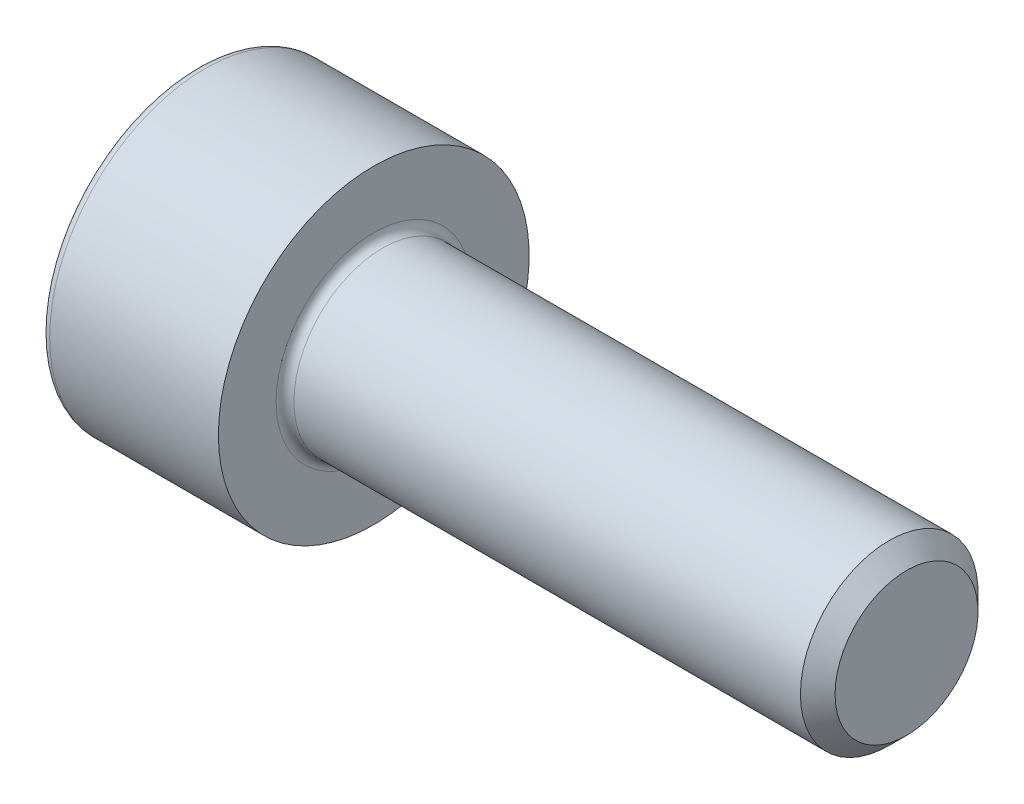
ISO-10303-21;
HEADER;
FILE_DESCRIPTION(('STEP AP214'),'2;1');
FILE_NAME('part.step','',(''),(''),'','','');
FILE_SCHEMA(('AUTOMOTIVE_DESIGN { 1 0 10303 214 1 1 1 1 }'));
ENDSEC;
DATA;
#1=APPLICATION_CONTEXT('core data for automotive mechanical design processes');
#2=APPLICATION_PROTOCOL_DEFINITION('international standard','automotive_design',2000,#1);
#3=PRODUCT_CONTEXT('',#1,'mechanical');
#4=PRODUCT('Part','Part','',(#3));
#5=PRODUCT_RELATED_PRODUCT_CATEGORY('part','',(#4));
#6=PRODUCT_DEFINITION_FORMATION('','',#4);
#7=PRODUCT_DEFINITION_CONTEXT('part definition',#1,'design');
#8=PRODUCT_DEFINITION('design','',#6,#7);
#9=PRODUCT_DEFINITION_SHAPE('','',#8);
#10=(LENGTH_UNIT() NAMED_UNIT(*) SI_UNIT(.MILLI.,.METRE.));
#11=(NAMED_UNIT(*) PLANE_ANGLE_UNIT() SI_UNIT($,.RADIAN.));
#12=(NAMED_UNIT(*) SI_UNIT($,.STERADIAN.) SOLID_ANGLE_UNIT());
#13=UNCERTAINTY_MEASURE_WITH_UNIT(LENGTH_MEASURE(1.E-05),#10,'distance_accuracy_value','');
#14=(GEOMETRIC_REPRESENTATION_CONTEXT(3) GLOBAL_UNCERTAINTY_ASSIGNED_CONTEXT((#13)) GLOBAL_UNIT_ASSIGNED_CONTEXT((#10,
#11,#12)) REPRESENTATION_CONTEXT('',''));
#15=CARTESIAN_POINT('',(0.,0.,0.));
#16=DIRECTION('',(0.,0.,1.));
#17=DIRECTION('',(1.,0.,0.));
#18=AXIS2_PLACEMENT_3D('',#15,#16,#17);
#19=CARTESIAN_POINT('',(0.,0.,0.));
#20=DIRECTION('',(-1.,0.,0.));
#21=DIRECTION('',(0.,0.,1.));
#22=AXIS2_PLACEMENT_3D('',#19,#20,#21);
#23=PLANE('',#22);
#24=DIRECTION('',(0.,-0.499999999999999,0.866025403784439));
#25=VECTOR('',#24,1.);
#26=CARTESIAN_POINT('',(0.,1.77304267668134,0.));
#27=LINE('',#26,#25);
#28=CARTESIAN_POINT('',(0.,1.77304267668134,0.));
#29=VERTEX_POINT('',#28);
#30=CARTESIAN_POINT('',(0.,0.886521338340669,1.5355));
#31=VERTEX_POINT('',#30);
#32=EDGE_CURVE('E109',#29,#31,#27,.T.);
#33=ORIENTED_EDGE('',*,*,#32,.T.);
#34=DIRECTION('',(0.,1.,0.));
#35=VECTOR('',#34,1.);
#36=CARTESIAN_POINT('',(0.,-0.886521338340671,1.5355));
#37=LINE('',#36,#35);
#38=CARTESIAN_POINT('',(0.,-0.886521338340671,1.5355));
#39=VERTEX_POINT('',#38);
#40=EDGE_CURVE('E98',#39,#31,#37,.T.);
#41=ORIENTED_EDGE('',*,*,#40,.F.);
#42=DIRECTION('',(0.,-0.500000000000001,-0.866025403784438));
#43=VECTOR('',#42,1.);
#44=CARTESIAN_POINT('',(0.,-0.886521338340671,1.5355));
#45=LINE('',#44,#43);
#46=CARTESIAN_POINT('',(0.,-1.77304267668134,0.));
#47=VERTEX_POINT('',#46);
#48=EDGE_CURVE('E108',#39,#47,#45,.T.);
#49=ORIENTED_EDGE('',*,*,#48,.T.);
#50=DIRECTION('',(0.,0.499999999999999,-0.866025403784439));
#51=VECTOR('',#50,1.);
#52=CARTESIAN_POINT('',(0.,-1.77304267668134,0.));
#53=LINE('',#52,#51);
#54=CARTESIAN_POINT('',(0.,-0.886521338340675,-1.5355));
#55=VERTEX_POINT('',#54);
#56=EDGE_CURVE('E123',#47,#55,#53,.T.);
#57=ORIENTED_EDGE('',*,*,#56,.T.);
#58=DIRECTION('',(0.,-1.,0.));
#59=VECTOR('',#58,1.);
#60=CARTESIAN_POINT('',(0.,0.886521338340665,-1.5355));
#61=LINE('',#60,#59);
#62=CARTESIAN_POINT('',(0.,0.886521338340665,-1.5355));
#63=VERTEX_POINT('',#62);
#64=EDGE_CURVE('E126',#63,#55,#61,.T.);
#65=ORIENTED_EDGE('',*,*,#64,.F.);
#66=DIRECTION('',(0.,-0.500000000000001,-0.866025403784438));
#67=VECTOR('',#66,1.);
#68=CARTESIAN_POINT('',(0.,1.77304267668134,0.));
#69=LINE('',#68,#67);
#70=EDGE_CURVE('E118',#29,#63,#69,.T.);
#71=ORIENTED_EDGE('',*,*,#70,.F.);
#72=EDGE_LOOP('',(#33,#41,#49,#57,#65,#71));
#73=FACE_BOUND('',#72,.T.);
#74=CARTESIAN_POINT('',(0.,0.,0.));
#75=DIRECTION('',(-1.,0.,0.));
#76=DIRECTION('',(0.,0.,1.));
#77=AXIS2_PLACEMENT_3D('',#74,#75,#76);
#78=CIRCLE('',#77,3.3);
#79=CARTESIAN_POINT('',(0.,0.,3.3));
#80=VERTEX_POINT('',#79);
#81=EDGE_CURVE('E33',#80,#80,#78,.T.);
#82=ORIENTED_EDGE('',*,*,#81,.T.);
#83=EDGE_LOOP('',(#82));
#84=FACE_BOUND('',#83,.T.);
#85=ADVANCED_FACE('F26',(#73,#84),#23,.T.);
#86=CARTESIAN_POINT('',(-31.75,0.,0.));
#87=DIRECTION('',(-1.,0.,0.));
#88=DIRECTION('',(0.,0.,1.));
#89=AXIS2_PLACEMENT_3D('',#86,#87,#88);
#90=CYLINDRICAL_SURFACE('',#89,3.5);
#91=CARTESIAN_POINT('',(0.199999999999999,0.,0.));
#92=DIRECTION('',(-1.,0.,0.));
#93=DIRECTION('',(0.,0.,1.));
#94=AXIS2_PLACEMENT_3D('',#91,#92,#93);
#95=CIRCLE('',#94,3.5);
#96=CARTESIAN_POINT('',(0.199999999999999,0.,3.5));
#97=VERTEX_POINT('',#96);
#98=EDGE_CURVE('E11',#97,#97,#95,.F.);
#99=ORIENTED_EDGE('',*,*,#98,.T.);
#100=EDGE_LOOP('',(#99));
#101=FACE_BOUND('',#100,.T.);
#102=CARTESIAN_POINT('',(4.,0.,0.));
#103=DIRECTION('',(-1.,0.,0.));
#104=DIRECTION('',(0.,0.,1.));
#105=AXIS2_PLACEMENT_3D('',#102,#103,#104);
#106=CIRCLE('',#105,3.5);
#107=CARTESIAN_POINT('',(4.,0.,3.5));
#108=VERTEX_POINT('',#107);
#109=EDGE_CURVE('E172',#108,#108,#106,.T.);
#110=ORIENTED_EDGE('',*,*,#109,.T.);
#111=EDGE_LOOP('',(#110));
#112=FACE_BOUND('',#111,.T.);
#113=ADVANCED_FACE('F200',(#101,#112),#90,.T.);
#114=CARTESIAN_POINT('',(4.,3.5,0.));
#115=DIRECTION('',(1.,0.,0.));
#116=DIRECTION('',(0.,0.,-1.));
#117=AXIS2_PLACEMENT_3D('',#114,#115,#116);
#118=PLANE('',#117);
#119=CARTESIAN_POINT('',(4.,0.,0.));
#120=DIRECTION('',(1.,0.,0.));
#121=DIRECTION('',(0.,0.,-1.));
#122=AXIS2_PLACEMENT_3D('',#119,#120,#121);
#123=CIRCLE('',#122,2.2);
#124=CARTESIAN_POINT('',(4.,0.,-2.2));
#125=VERTEX_POINT('',#124);
#126=EDGE_CURVE('E175',#125,#125,#123,.F.);
#127=ORIENTED_EDGE('',*,*,#126,.T.);
#128=EDGE_LOOP('',(#127));
#129=FACE_BOUND('',#128,.T.);
#130=ORIENTED_EDGE('',*,*,#109,.F.);
#131=EDGE_LOOP('',(#130));
#132=FACE_BOUND('',#131,.T.);
#133=ADVANCED_FACE('F203',(#129,#132),#118,.T.);
#134=CARTESIAN_POINT('',(-31.75,0.,0.));
#135=DIRECTION('',(-1.,0.,0.));
#136=DIRECTION('',(0.,0.,1.));
#137=AXIS2_PLACEMENT_3D('',#134,#135,#136);
#138=CYLINDRICAL_SURFACE('',#137,2.);
#139=CARTESIAN_POINT('',(4.2,0.,0.));
#140=DIRECTION('',(1.,0.,0.));
#141=DIRECTION('',(0.,0.,-1.));
#142=AXIS2_PLACEMENT_3D('',#139,#140,#141);
#143=CIRCLE('',#142,2.);
#144=CARTESIAN_POINT('',(4.2,0.,-2.));
#145=VERTEX_POINT('',#144);
#146=EDGE_CURVE('E178',#145,#145,#143,.T.);
#147=ORIENTED_EDGE('',*,*,#146,.T.);
#148=EDGE_LOOP('',(#147));
#149=FACE_BOUND('',#148,.T.);
#150=CARTESIAN_POINT('',(15.61,0.,0.));
#151=DIRECTION('',(-1.,0.,0.));
#152=DIRECTION('',(0.,0.,1.));
#153=AXIS2_PLACEMENT_3D('',#150,#151,#152);
#154=CIRCLE('',#153,2.);
#155=CARTESIAN_POINT('',(15.61,0.,2.));
#156=VERTEX_POINT('',#155);
#157=EDGE_CURVE('E169',#156,#156,#154,.T.);
#158=ORIENTED_EDGE('',*,*,#157,.T.);
#159=EDGE_LOOP('',(#158));
#160=FACE_BOUND('',#159,.T.);
#161=ADVANCED_FACE('F208',(#149,#160),#138,.T.);
#162=CARTESIAN_POINT('',(16.,0.,0.));
#163=DIRECTION('',(-1.,0.,0.));
#164=DIRECTION('',(0.,0.,1.));
#165=AXIS2_PLACEMENT_3D('',#162,#163,#164);
#166=CONICAL_SURFACE('',#165,1.61,0.785398163397482);
#167=ORIENTED_EDGE('',*,*,#157,.F.);
#168=EDGE_LOOP('',(#167));
#169=FACE_BOUND('',#168,.T.);
#170=CARTESIAN_POINT('',(16.,0.,0.));
#171=DIRECTION('',(-1.,0.,0.));
#172=DIRECTION('',(0.,0.,1.));
#173=AXIS2_PLACEMENT_3D('',#170,#171,#172);
#174=CIRCLE('',#173,1.61);
#175=CARTESIAN_POINT('',(16.,0.,1.61));
#176=VERTEX_POINT('',#175);
#177=EDGE_CURVE('E165',#176,#176,#174,.T.);
#178=ORIENTED_EDGE('',*,*,#177,.T.);
#179=EDGE_LOOP('',(#178));
#180=FACE_BOUND('',#179,.T.);
#181=ADVANCED_FACE('F215',(#169,#180),#166,.T.);
#182=CARTESIAN_POINT('',(16.,1.61,0.));
#183=DIRECTION('',(1.,0.,0.));
#184=DIRECTION('',(0.,0.,-1.));
#185=AXIS2_PLACEMENT_3D('',#182,#183,#184);
#186=PLANE('',#185);
#187=ORIENTED_EDGE('',*,*,#177,.F.);
#188=EDGE_LOOP('',(#187));
#189=FACE_BOUND('',#188,.T.);
#190=ADVANCED_FACE('F195',(#189),#186,.T.);
#191=CARTESIAN_POINT('',(4.2,0.,0.));
#192=DIRECTION('',(1.,0.,0.));
#193=DIRECTION('',(0.,0.,-1.));
#194=AXIS2_PLACEMENT_3D('',#191,#192,#193);
#195=TOROIDAL_SURFACE('',#194,2.2,0.2);
#196=ORIENTED_EDGE('',*,*,#146,.F.);
#197=EDGE_LOOP('',(#196));
#198=FACE_BOUND('',#197,.T.);
#199=ORIENTED_EDGE('',*,*,#126,.F.);
#200=EDGE_LOOP('',(#199));
#201=FACE_BOUND('',#200,.T.);
#202=ADVANCED_FACE('F185',(#198,#201),#195,.F.);
#203=CARTESIAN_POINT('',(0.199999999999999,0.,0.));
#204=DIRECTION('',(-1.,0.,0.));
#205=DIRECTION('',(0.,0.,1.));
#206=AXIS2_PLACEMENT_3D('',#203,#204,#205);
#207=TOROIDAL_SURFACE('',#206,3.3,0.2);
#208=ORIENTED_EDGE('',*,*,#98,.F.);
#209=EDGE_LOOP('',(#208));
#210=FACE_BOUND('',#209,.T.);
#211=ORIENTED_EDGE('',*,*,#81,.F.);
#212=EDGE_LOOP('',(#211));
#213=FACE_BOUND('',#212,.T.);
#214=ADVANCED_FACE('F183',(#210,#213),#207,.T.);
#215=CARTESIAN_POINT('',(2.,1.77304267668134,0.));
#216=DIRECTION('',(0.,-0.866025403784439,-0.499999999999999));
#217=DIRECTION('',(0.,0.499999999999999,-0.866025403784439));
#218=AXIS2_PLACEMENT_3D('',#215,#216,#217);
#219=PLANE('',#218);
#220=ORIENTED_EDGE('',*,*,#32,.F.);
#221=DIRECTION('',(-1.,0.,0.));
#222=VECTOR('',#221,1.);
#223=CARTESIAN_POINT('',(2.,1.77304267668134,0.));
#224=LINE('',#223,#222);
#225=CARTESIAN_POINT('',(2.,1.77304267668134,0.));
#226=VERTEX_POINT('',#225);
#227=EDGE_CURVE('E150',#226,#29,#224,.T.);
#228=ORIENTED_EDGE('',*,*,#227,.F.);
#229=DIRECTION('',(0.,-0.499999999999999,0.866025403784439));
#230=VECTOR('',#229,1.);
#231=CARTESIAN_POINT('',(2.,1.77304267668134,0.));
#232=LINE('',#231,#230);
#233=CARTESIAN_POINT('',(2.,1.32978200751101,0.767749999999998));
#234=VERTEX_POINT('',#233);
#235=EDGE_CURVE('E40',#226,#234,#232,.T.);
#236=ORIENTED_EDGE('',*,*,#235,.T.);
#237=CARTESIAN_POINT('',(2.,0.886521338340669,1.5355));
#238=VERTEX_POINT('',#237);
#239=EDGE_CURVE('E113',#234,#238,#232,.T.);
#240=ORIENTED_EDGE('',*,*,#239,.T.);
#241=DIRECTION('',(-1.,0.,0.));
#242=VECTOR('',#241,1.);
#243=CARTESIAN_POINT('',(2.,0.886521338340669,1.5355));
#244=LINE('',#243,#242);
#245=EDGE_CURVE('E102',#238,#31,#244,.T.);
#246=ORIENTED_EDGE('',*,*,#245,.T.);
#247=EDGE_LOOP('',(#220,#228,#236,#240,#246));
#248=FACE_BOUND('',#247,.T.);
#249=ADVANCED_FACE('F111',(#248),#219,.T.);
#250=CARTESIAN_POINT('',(2.,-0.886521338340671,1.5355));
#251=DIRECTION('',(0.,0.,1.));
#252=DIRECTION('',(0.,-1.,0.));
#253=AXIS2_PLACEMENT_3D('',#250,#251,#252);
#254=PLANE('',#253);
#255=ORIENTED_EDGE('',*,*,#40,.T.);
#256=ORIENTED_EDGE('',*,*,#245,.F.);
#257=DIRECTION('',(0.,1.,0.));
#258=VECTOR('',#257,1.);
#259=CARTESIAN_POINT('',(2.,-0.886521338340671,1.5355));
#260=LINE('',#259,#258);
#261=CARTESIAN_POINT('',(2.,0.,1.5355));
#262=VERTEX_POINT('',#261);
#263=EDGE_CURVE('E130',#262,#238,#260,.T.);
#264=ORIENTED_EDGE('',*,*,#263,.F.);
#265=CARTESIAN_POINT('',(2.,-0.886521338340671,1.5355));
#266=VERTEX_POINT('',#265);
#267=EDGE_CURVE('E131',#266,#262,#260,.T.);
#268=ORIENTED_EDGE('',*,*,#267,.F.);
#269=DIRECTION('',(-1.,0.,0.));
#270=VECTOR('',#269,1.);
#271=CARTESIAN_POINT('',(2.,-0.886521338340671,1.5355));
#272=LINE('',#271,#270);
#273=EDGE_CURVE('E104',#266,#39,#272,.T.);
#274=ORIENTED_EDGE('',*,*,#273,.T.);
#275=EDGE_LOOP('',(#255,#256,#264,#268,#274));
#276=FACE_BOUND('',#275,.T.);
#277=ADVANCED_FACE('F100',(#276),#254,.F.);
#278=CARTESIAN_POINT('',(2.,-0.886521338340671,1.5355));
#279=DIRECTION('',(0.,0.866025403784438,-0.500000000000001));
#280=DIRECTION('',(0.,0.500000000000001,0.866025403784438));
#281=AXIS2_PLACEMENT_3D('',#278,#279,#280);
#282=PLANE('',#281);
#283=ORIENTED_EDGE('',*,*,#48,.F.);
#284=ORIENTED_EDGE('',*,*,#273,.F.);
#285=DIRECTION('',(0.,-0.500000000000001,-0.866025403784438));
#286=VECTOR('',#285,1.);
#287=CARTESIAN_POINT('',(2.,-0.886521338340671,1.5355));
#288=LINE('',#287,#286);
#289=CARTESIAN_POINT('',(2.,-1.329782007511,0.767750000000002));
#290=VERTEX_POINT('',#289);
#291=EDGE_CURVE('E135',#266,#290,#288,.T.);
#292=ORIENTED_EDGE('',*,*,#291,.T.);
#293=CARTESIAN_POINT('',(2.,-1.77304267668134,0.));
#294=VERTEX_POINT('',#293);
#295=EDGE_CURVE('E134',#290,#294,#288,.T.);
#296=ORIENTED_EDGE('',*,*,#295,.T.);
#297=DIRECTION('',(-1.,0.,0.));
#298=VECTOR('',#297,1.);
#299=CARTESIAN_POINT('',(2.,-1.77304267668134,0.));
#300=LINE('',#299,#298);
#301=EDGE_CURVE('E158',#294,#47,#300,.T.);
#302=ORIENTED_EDGE('',*,*,#301,.T.);
#303=EDGE_LOOP('',(#283,#284,#292,#296,#302));
#304=FACE_BOUND('',#303,.T.);
#305=ADVANCED_FACE('F263',(#304),#282,.T.);
#306=CARTESIAN_POINT('',(2.,-1.77304267668134,0.));
#307=DIRECTION('',(0.,0.866025403784439,0.499999999999999));
#308=DIRECTION('',(0.,-0.499999999999999,0.866025403784439));
#309=AXIS2_PLACEMENT_3D('',#306,#307,#308);
#310=PLANE('',#309);
#311=ORIENTED_EDGE('',*,*,#56,.F.);
#312=ORIENTED_EDGE('',*,*,#301,.F.);
#313=DIRECTION('',(0.,0.499999999999999,-0.866025403784439));
#314=VECTOR('',#313,1.);
#315=CARTESIAN_POINT('',(2.,-1.77304267668134,0.));
#316=LINE('',#315,#314);
#317=CARTESIAN_POINT('',(2.,-1.32978200751101,-0.76775));
#318=VERTEX_POINT('',#317);
#319=EDGE_CURVE('E139',#294,#318,#316,.T.);
#320=ORIENTED_EDGE('',*,*,#319,.T.);
#321=CARTESIAN_POINT('',(2.,-0.886521338340675,-1.5355));
#322=VERTEX_POINT('',#321);
#323=EDGE_CURVE('E138',#318,#322,#316,.T.);
#324=ORIENTED_EDGE('',*,*,#323,.T.);
#325=DIRECTION('',(-1.,0.,0.));
#326=VECTOR('',#325,1.);
#327=CARTESIAN_POINT('',(2.,-0.886521338340675,-1.5355));
#328=LINE('',#327,#326);
#329=EDGE_CURVE('E155',#322,#55,#328,.T.);
#330=ORIENTED_EDGE('',*,*,#329,.T.);
#331=EDGE_LOOP('',(#311,#312,#320,#324,#330));
#332=FACE_BOUND('',#331,.T.);
#333=ADVANCED_FACE('F270',(#332),#310,.T.);
#334=CARTESIAN_POINT('',(2.,0.886521338340665,-1.5355));
#335=DIRECTION('',(0.,0.,-1.));
#336=DIRECTION('',(0.,1.,0.));
#337=AXIS2_PLACEMENT_3D('',#334,#335,#336);
#338=PLANE('',#337);
#339=ORIENTED_EDGE('',*,*,#64,.T.);
#340=ORIENTED_EDGE('',*,*,#329,.F.);
#341=DIRECTION('',(0.,-1.,0.));
#342=VECTOR('',#341,1.);
#343=CARTESIAN_POINT('',(2.,0.886521338340665,-1.5355));
#344=LINE('',#343,#342);
#345=CARTESIAN_POINT('',(2.,0.,-1.5355));
#346=VERTEX_POINT('',#345);
#347=EDGE_CURVE('E142',#346,#322,#344,.T.);
#348=ORIENTED_EDGE('',*,*,#347,.F.);
#349=CARTESIAN_POINT('',(2.,0.886521338340665,-1.5355));
#350=VERTEX_POINT('',#349);
#351=EDGE_CURVE('E143',#350,#346,#344,.T.);
#352=ORIENTED_EDGE('',*,*,#351,.F.);
#353=DIRECTION('',(-1.,0.,0.));
#354=VECTOR('',#353,1.);
#355=CARTESIAN_POINT('',(2.,0.886521338340665,-1.5355));
#356=LINE('',#355,#354);
#357=EDGE_CURVE('E152',#350,#63,#356,.T.);
#358=ORIENTED_EDGE('',*,*,#357,.T.);
#359=EDGE_LOOP('',(#339,#340,#348,#352,#358));
#360=FACE_BOUND('',#359,.T.);
#361=ADVANCED_FACE('F278',(#360),#338,.F.);
#362=CARTESIAN_POINT('',(2.,1.77304267668134,0.));
#363=DIRECTION('',(0.,0.866025403784438,-0.500000000000001));
#364=DIRECTION('',(0.,0.500000000000001,0.866025403784438));
#365=AXIS2_PLACEMENT_3D('',#362,#363,#364);
#366=PLANE('',#365);
#367=ORIENTED_EDGE('',*,*,#70,.T.);
#368=ORIENTED_EDGE('',*,*,#357,.F.);
#369=DIRECTION('',(0.,-0.500000000000001,-0.866025403784438));
#370=VECTOR('',#369,1.);
#371=CARTESIAN_POINT('',(2.,1.77304267668134,0.));
#372=LINE('',#371,#370);
#373=CARTESIAN_POINT('',(2.,1.329782007511,-0.767750000000001));
#374=VERTEX_POINT('',#373);
#375=EDGE_CURVE('E146',#374,#350,#372,.T.);
#376=ORIENTED_EDGE('',*,*,#375,.F.);
#377=EDGE_CURVE('E147',#226,#374,#372,.T.);
#378=ORIENTED_EDGE('',*,*,#377,.F.);
#379=ORIENTED_EDGE('',*,*,#227,.T.);
#380=EDGE_LOOP('',(#367,#368,#376,#378,#379));
#381=FACE_BOUND('',#380,.T.);
#382=ADVANCED_FACE('F286',(#381),#366,.F.);
#383=CARTESIAN_POINT('',(2.,0.88652133834067,1.5355));
#384=DIRECTION('',(-1.,0.,0.));
#385=DIRECTION('',(0.,0.,1.));
#386=AXIS2_PLACEMENT_3D('',#383,#384,#385);
#387=PLANE('',#386);
#388=CARTESIAN_POINT('',(2.,0.,0.));
#389=DIRECTION('',(-1.,0.,0.));
#390=DIRECTION('',(0.,0.,1.));
#391=AXIS2_PLACEMENT_3D('',#388,#389,#390);
#392=CIRCLE('',#391,1.5355);
#393=EDGE_CURVE('E114',#290,#262,#392,.T.);
#394=ORIENTED_EDGE('',*,*,#393,.F.);
#395=ORIENTED_EDGE('',*,*,#291,.F.);
#396=ORIENTED_EDGE('',*,*,#267,.T.);
#397=EDGE_LOOP('',(#394,#395,#396));
#398=FACE_BOUND('',#397,.T.);
#399=ADVANCED_FACE('F294',(#398),#387,.T.);
#400=EDGE_CURVE('E345',#318,#290,#392,.T.);
#401=ORIENTED_EDGE('',*,*,#400,.F.);
#402=ORIENTED_EDGE('',*,*,#319,.F.);
#403=ORIENTED_EDGE('',*,*,#295,.F.);
#404=EDGE_LOOP('',(#401,#402,#403));
#405=FACE_BOUND('',#404,.T.);
#406=ADVANCED_FACE('F302',(#405),#387,.T.);
#407=EDGE_CURVE('E346',#346,#318,#392,.T.);
#408=ORIENTED_EDGE('',*,*,#407,.F.);
#409=ORIENTED_EDGE('',*,*,#347,.T.);
#410=ORIENTED_EDGE('',*,*,#323,.F.);
#411=EDGE_LOOP('',(#408,#409,#410));
#412=FACE_BOUND('',#411,.T.);
#413=ADVANCED_FACE('F310',(#412),#387,.T.);
#414=EDGE_CURVE('E347',#374,#346,#392,.T.);
#415=ORIENTED_EDGE('',*,*,#414,.F.);
#416=ORIENTED_EDGE('',*,*,#375,.T.);
#417=ORIENTED_EDGE('',*,*,#351,.T.);
#418=EDGE_LOOP('',(#415,#416,#417));
#419=FACE_BOUND('',#418,.T.);
#420=ADVANCED_FACE('F317',(#419),#387,.T.);
#421=EDGE_CURVE('E166',#234,#374,#392,.T.);
#422=ORIENTED_EDGE('',*,*,#421,.F.);
#423=ORIENTED_EDGE('',*,*,#235,.F.);
#424=ORIENTED_EDGE('',*,*,#377,.T.);
#425=EDGE_LOOP('',(#422,#423,#424));
#426=FACE_BOUND('',#425,.T.);
#427=ADVANCED_FACE('F324',(#426),#387,.T.);
#428=EDGE_CURVE('E162',#262,#234,#392,.T.);
#429=ORIENTED_EDGE('',*,*,#428,.F.);
#430=ORIENTED_EDGE('',*,*,#263,.T.);
#431=ORIENTED_EDGE('',*,*,#239,.F.);
#432=EDGE_LOOP('',(#429,#430,#431));
#433=FACE_BOUND('',#432,.T.);
#434=ADVANCED_FACE('F249',(#433),#387,.T.);
#435=CARTESIAN_POINT('',(2.,0.,0.));
#436=DIRECTION('',(-1.,0.,0.));
#437=DIRECTION('',(0.,0.,1.));
#438=AXIS2_PLACEMENT_3D('',#435,#436,#437);
#439=CONICAL_SURFACE('',#438,1.5355,1.04719755119659);
#440=CARTESIAN_POINT('',(2.88652133834068,0.,0.));
#441=VERTEX_POINT('',#440);
#442=VERTEX_LOOP('',#441);
#443=FACE_BOUND('',#442,.T.);
#444=ORIENTED_EDGE('',*,*,#428,.T.);
#445=ORIENTED_EDGE('',*,*,#421,.T.);
#446=ORIENTED_EDGE('',*,*,#414,.T.);
#447=ORIENTED_EDGE('',*,*,#407,.T.);
#448=ORIENTED_EDGE('',*,*,#400,.T.);
#449=ORIENTED_EDGE('',*,*,#393,.T.);
#450=EDGE_LOOP('',(#444,#445,#446,#447,#448,#449));
#451=FACE_BOUND('',#450,.T.);
#452=ADVANCED_FACE('F245',(#443,#451),#439,.F.);
#453=CLOSED_SHELL('',(#85,#113,#133,#161,#181,#190,#202,#214,#249,#277,#305,#333,#361,#382,#399,
#406,#413,#420,#427,#434,#452));
#454=MANIFOLD_SOLID_BREP('B2',#453);
#455=ADVANCED_BREP_SHAPE_REPRESENTATION('',(#18,#454),#14);
#456=SHAPE_DEFINITION_REPRESENTATION(#9,#455);
ENDSEC;
END-ISO-10303-21;
